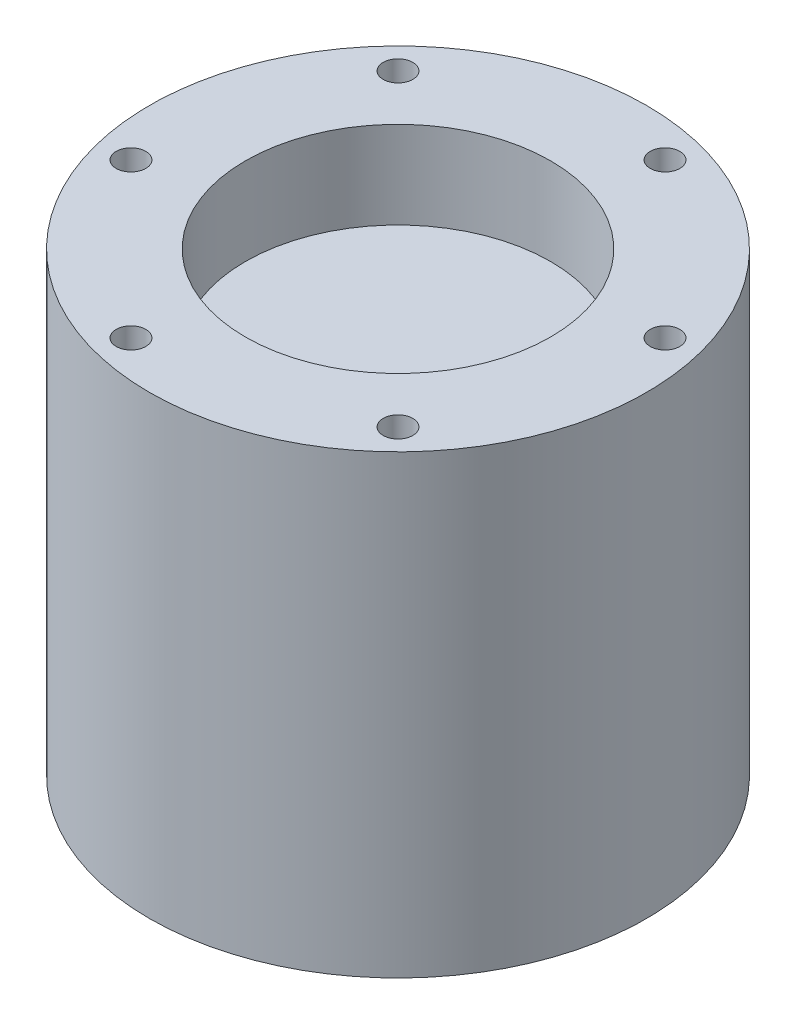
ISO-10303-21;
HEADER;
FILE_DESCRIPTION(('STEP AP214'),'2;1');
FILE_NAME('part.step','',(''),(''),'','','');
FILE_SCHEMA(('AUTOMOTIVE_DESIGN { 1 0 10303 214 1 1 1 1 }'));
ENDSEC;
DATA;
#1=APPLICATION_CONTEXT('core data for automotive mechanical design processes');
#2=APPLICATION_PROTOCOL_DEFINITION('international standard','automotive_design',2000,#1);
#3=PRODUCT_CONTEXT('',#1,'mechanical');
#4=PRODUCT('Part','Part','',(#3));
#5=PRODUCT_RELATED_PRODUCT_CATEGORY('part','',(#4));
#6=PRODUCT_DEFINITION_FORMATION('','',#4);
#7=PRODUCT_DEFINITION_CONTEXT('part definition',#1,'design');
#8=PRODUCT_DEFINITION('design','',#6,#7);
#9=PRODUCT_DEFINITION_SHAPE('','',#8);
#10=(LENGTH_UNIT() NAMED_UNIT(*) SI_UNIT(.MILLI.,.METRE.));
#11=(NAMED_UNIT(*) PLANE_ANGLE_UNIT() SI_UNIT($,.RADIAN.));
#12=(NAMED_UNIT(*) SI_UNIT($,.STERADIAN.) SOLID_ANGLE_UNIT());
#13=UNCERTAINTY_MEASURE_WITH_UNIT(LENGTH_MEASURE(1.E-05),#10,'distance_accuracy_value','');
#14=(GEOMETRIC_REPRESENTATION_CONTEXT(3) GLOBAL_UNCERTAINTY_ASSIGNED_CONTEXT((#13)) GLOBAL_UNIT_ASSIGNED_CONTEXT((#10,
#11,#12)) REPRESENTATION_CONTEXT('',''));
#15=CARTESIAN_POINT('',(0.,0.,0.));
#16=DIRECTION('',(0.,0.,1.));
#17=DIRECTION('',(1.,0.,0.));
#18=AXIS2_PLACEMENT_3D('',#15,#16,#17);
#19=CARTESIAN_POINT('',(0.,52.25,0.));
#20=DIRECTION('',(0.,-1.,0.));
#21=DIRECTION('',(0.,0.,-1.));
#22=AXIS2_PLACEMENT_3D('',#19,#20,#21);
#23=CYLINDRICAL_SURFACE('',#22,28.5);
#24=CARTESIAN_POINT('',(0.,52.25,0.));
#25=DIRECTION('',(0.,1.,0.));
#26=DIRECTION('',(0.,0.,1.));
#27=AXIS2_PLACEMENT_3D('',#24,#25,#26);
#28=CIRCLE('',#27,28.5);
#29=CARTESIAN_POINT('',(0.,52.25,28.5));
#30=VERTEX_POINT('',#29);
#31=EDGE_CURVE('E10',#30,#30,#28,.T.);
#32=ORIENTED_EDGE('',*,*,#31,.F.);
#33=EDGE_LOOP('',(#32));
#34=FACE_BOUND('',#33,.T.);
#35=CARTESIAN_POINT('',(0.,0.,0.));
#36=DIRECTION('',(0.,1.,0.));
#37=DIRECTION('',(0.,0.,1.));
#38=AXIS2_PLACEMENT_3D('',#35,#36,#37);
#39=CIRCLE('',#38,28.5);
#40=CARTESIAN_POINT('',(0.,0.,28.5));
#41=VERTEX_POINT('',#40);
#42=EDGE_CURVE('E37',#41,#41,#39,.T.);
#43=ORIENTED_EDGE('',*,*,#42,.T.);
#44=EDGE_LOOP('',(#43));
#45=FACE_BOUND('',#44,.T.);
#46=ADVANCED_FACE('F34',(#34,#45),#23,.T.);
#47=CARTESIAN_POINT('',(0.,52.25,0.));
#48=DIRECTION('',(0.,1.,0.));
#49=DIRECTION('',(0.,0.,1.));
#50=AXIS2_PLACEMENT_3D('',#47,#48,#49);
#51=PLANE('',#50);
#52=CARTESIAN_POINT('',(-6.47047612756301,52.25,24.1481456572267));
#53=DIRECTION('',(0.,1.,0.));
#54=DIRECTION('',(0.,0.,1.));
#55=AXIS2_PLACEMENT_3D('',#52,#53,#54);
#56=CIRCLE('',#55,1.7);
#57=CARTESIAN_POINT('',(-6.47047612756301,52.25,25.8481456572267));
#58=VERTEX_POINT('',#57);
#59=EDGE_CURVE('E83',#58,#58,#56,.T.);
#60=ORIENTED_EDGE('',*,*,#59,.F.);
#61=EDGE_LOOP('',(#60));
#62=FACE_BOUND('',#61,.T.);
#63=CARTESIAN_POINT('',(-24.1481456572267,52.25,6.47047612756303));
#64=DIRECTION('',(0.,1.,0.));
#65=DIRECTION('',(0.,0.,1.));
#66=AXIS2_PLACEMENT_3D('',#63,#64,#65);
#67=CIRCLE('',#66,1.7);
#68=CARTESIAN_POINT('',(-24.1481456572267,52.25,8.17047612756303));
#69=VERTEX_POINT('',#68);
#70=EDGE_CURVE('E77',#69,#69,#67,.T.);
#71=ORIENTED_EDGE('',*,*,#70,.F.);
#72=EDGE_LOOP('',(#71));
#73=FACE_BOUND('',#72,.T.);
#74=CARTESIAN_POINT('',(-17.6776695296637,52.25,-17.6776695296637));
#75=DIRECTION('',(0.,1.,0.));
#76=DIRECTION('',(0.,0.,1.));
#77=AXIS2_PLACEMENT_3D('',#74,#75,#76);
#78=CIRCLE('',#77,1.7);
#79=CARTESIAN_POINT('',(-17.6776695296637,52.25,-15.9776695296637));
#80=VERTEX_POINT('',#79);
#81=EDGE_CURVE('E71',#80,#80,#78,.T.);
#82=ORIENTED_EDGE('',*,*,#81,.F.);
#83=EDGE_LOOP('',(#82));
#84=FACE_BOUND('',#83,.T.);
#85=CARTESIAN_POINT('',(6.470476127563,52.25,-24.1481456572267));
#86=DIRECTION('',(0.,1.,0.));
#87=DIRECTION('',(0.,0.,1.));
#88=AXIS2_PLACEMENT_3D('',#85,#86,#87);
#89=CIRCLE('',#88,1.7);
#90=CARTESIAN_POINT('',(6.470476127563,52.25,-22.4481456572267));
#91=VERTEX_POINT('',#90);
#92=EDGE_CURVE('E65',#91,#91,#89,.T.);
#93=ORIENTED_EDGE('',*,*,#92,.F.);
#94=EDGE_LOOP('',(#93));
#95=FACE_BOUND('',#94,.T.);
#96=CARTESIAN_POINT('',(24.1481456572267,52.25,-6.47047612756303));
#97=DIRECTION('',(0.,1.,0.));
#98=DIRECTION('',(0.,0.,1.));
#99=AXIS2_PLACEMENT_3D('',#96,#97,#98);
#100=CIRCLE('',#99,1.7);
#101=CARTESIAN_POINT('',(24.1481456572267,52.25,-4.77047612756303));
#102=VERTEX_POINT('',#101);
#103=EDGE_CURVE('E58',#102,#102,#100,.T.);
#104=ORIENTED_EDGE('',*,*,#103,.F.);
#105=EDGE_LOOP('',(#104));
#106=FACE_BOUND('',#105,.T.);
#107=CARTESIAN_POINT('',(17.6776695296637,52.25,17.6776695296637));
#108=DIRECTION('',(0.,1.,0.));
#109=DIRECTION('',(0.,0.,1.));
#110=AXIS2_PLACEMENT_3D('',#107,#108,#109);
#111=CIRCLE('',#110,1.69999999999995);
#112=CARTESIAN_POINT('',(17.6776695296637,52.25,19.3776695296636));
#113=VERTEX_POINT('',#112);
#114=EDGE_CURVE('E52',#113,#113,#111,.T.);
#115=ORIENTED_EDGE('',*,*,#114,.F.);
#116=EDGE_LOOP('',(#115));
#117=FACE_BOUND('',#116,.T.);
#118=CARTESIAN_POINT('',(0.,52.25,0.));
#119=DIRECTION('',(0.,1.,0.));
#120=DIRECTION('',(0.,0.,1.));
#121=AXIS2_PLACEMENT_3D('',#118,#119,#120);
#122=CIRCLE('',#121,17.5);
#123=CARTESIAN_POINT('',(0.,52.25,17.5));
#124=VERTEX_POINT('',#123);
#125=EDGE_CURVE('E46',#124,#124,#122,.T.);
#126=ORIENTED_EDGE('',*,*,#125,.F.);
#127=EDGE_LOOP('',(#126));
#128=FACE_BOUND('',#127,.T.);
#129=ORIENTED_EDGE('',*,*,#31,.T.);
#130=EDGE_LOOP('',(#129));
#131=FACE_BOUND('',#130,.T.);
#132=ADVANCED_FACE('F125',(#62,#73,#84,#95,#106,#117,#128,#131),#51,.T.);
#133=CARTESIAN_POINT('',(0.,0.,0.));
#134=DIRECTION('',(0.,1.,0.));
#135=DIRECTION('',(0.,0.,1.));
#136=AXIS2_PLACEMENT_3D('',#133,#134,#135);
#137=PLANE('',#136);
#138=CARTESIAN_POINT('',(-19.,0.,0.));
#139=DIRECTION('',(0.,-1.,0.));
#140=DIRECTION('',(0.,0.,-1.));
#141=AXIS2_PLACEMENT_3D('',#138,#139,#140);
#142=CIRCLE('',#141,1.5);
#143=CARTESIAN_POINT('',(-19.,0.,-1.49999999999993));
#144=VERTEX_POINT('',#143);
#145=EDGE_CURVE('E106',#144,#144,#142,.T.);
#146=ORIENTED_EDGE('',*,*,#145,.F.);
#147=EDGE_LOOP('',(#146));
#148=FACE_BOUND('',#147,.T.);
#149=CARTESIAN_POINT('',(1.32676290876039E-13,0.,19.));
#150=DIRECTION('',(0.,-1.,0.));
#151=DIRECTION('',(0.,0.,-1.));
#152=AXIS2_PLACEMENT_3D('',#149,#150,#151);
#153=CIRCLE('',#152,1.5);
#154=CARTESIAN_POINT('',(1.32676290876039E-13,0.,17.5));
#155=VERTEX_POINT('',#154);
#156=EDGE_CURVE('E100',#155,#155,#153,.T.);
#157=ORIENTED_EDGE('',*,*,#156,.F.);
#158=EDGE_LOOP('',(#157));
#159=FACE_BOUND('',#158,.T.);
#160=CARTESIAN_POINT('',(19.,0.,-1.99014436314059E-13));
#161=DIRECTION('',(0.,-1.,0.));
#162=DIRECTION('',(0.,0.,-1.));
#163=AXIS2_PLACEMENT_3D('',#160,#161,#162);
#164=CIRCLE('',#163,1.5);
#165=CARTESIAN_POINT('',(19.,0.,-1.5000000000002));
#166=VERTEX_POINT('',#165);
#167=EDGE_CURVE('E94',#166,#166,#164,.T.);
#168=ORIENTED_EDGE('',*,*,#167,.F.);
#169=EDGE_LOOP('',(#168));
#170=FACE_BOUND('',#169,.T.);
#171=CARTESIAN_POINT('',(0.,0.,-19.));
#172=DIRECTION('',(0.,-1.,0.));
#173=DIRECTION('',(0.,0.,-1.));
#174=AXIS2_PLACEMENT_3D('',#171,#172,#173);
#175=CIRCLE('',#174,1.5);
#176=CARTESIAN_POINT('',(0.,0.,-20.5));
#177=VERTEX_POINT('',#176);
#178=EDGE_CURVE('E88',#177,#177,#175,.T.);
#179=ORIENTED_EDGE('',*,*,#178,.F.);
#180=EDGE_LOOP('',(#179));
#181=FACE_BOUND('',#180,.T.);
#182=ORIENTED_EDGE('',*,*,#42,.F.);
#183=EDGE_LOOP('',(#182));
#184=FACE_BOUND('',#183,.T.);
#185=ADVANCED_FACE('F121',(#148,#159,#170,#181,#184),#137,.F.);
#186=CARTESIAN_POINT('',(0.,42.25,0.));
#187=DIRECTION('',(0.,1.,0.));
#188=DIRECTION('',(0.,0.,1.));
#189=AXIS2_PLACEMENT_3D('',#186,#187,#188);
#190=CYLINDRICAL_SURFACE('',#189,17.5);
#191=CARTESIAN_POINT('',(0.,42.25,0.));
#192=DIRECTION('',(0.,1.,0.));
#193=DIRECTION('',(0.,0.,1.));
#194=AXIS2_PLACEMENT_3D('',#191,#192,#193);
#195=CIRCLE('',#194,17.5);
#196=CARTESIAN_POINT('',(0.,42.25,17.5));
#197=VERTEX_POINT('',#196);
#198=EDGE_CURVE('E44',#197,#197,#195,.T.);
#199=ORIENTED_EDGE('',*,*,#198,.F.);
#200=EDGE_LOOP('',(#199));
#201=FACE_BOUND('',#200,.T.);
#202=ORIENTED_EDGE('',*,*,#125,.T.);
#203=EDGE_LOOP('',(#202));
#204=FACE_BOUND('',#203,.T.);
#205=ADVANCED_FACE('F124',(#201,#204),#190,.F.);
#206=CARTESIAN_POINT('',(0.,42.25,0.));
#207=DIRECTION('',(0.,1.,0.));
#208=DIRECTION('',(0.,0.,1.));
#209=AXIS2_PLACEMENT_3D('',#206,#207,#208);
#210=PLANE('',#209);
#211=ORIENTED_EDGE('',*,*,#198,.T.);
#212=EDGE_LOOP('',(#211));
#213=FACE_BOUND('',#212,.T.);
#214=ADVANCED_FACE('F150',(#213),#210,.T.);
#215=CARTESIAN_POINT('',(17.6776695296637,42.25,17.6776695296637));
#216=DIRECTION('',(0.,1.,0.));
#217=DIRECTION('',(0.,0.,1.));
#218=AXIS2_PLACEMENT_3D('',#215,#216,#217);
#219=CYLINDRICAL_SURFACE('',#218,1.69999999999995);
#220=CARTESIAN_POINT('',(17.6776695296637,42.25,17.6776695296637));
#221=DIRECTION('',(0.,1.,0.));
#222=DIRECTION('',(0.,0.,1.));
#223=AXIS2_PLACEMENT_3D('',#220,#221,#222);
#224=CIRCLE('',#223,1.69999999999995);
#225=CARTESIAN_POINT('',(17.6776695296637,42.25,19.3776695296636));
#226=VERTEX_POINT('',#225);
#227=EDGE_CURVE('E49',#226,#226,#224,.T.);
#228=ORIENTED_EDGE('',*,*,#227,.F.);
#229=EDGE_LOOP('',(#228));
#230=FACE_BOUND('',#229,.T.);
#231=ORIENTED_EDGE('',*,*,#114,.T.);
#232=EDGE_LOOP('',(#231));
#233=FACE_BOUND('',#232,.T.);
#234=ADVANCED_FACE('F154',(#230,#233),#219,.F.);
#235=CARTESIAN_POINT('',(17.6776695296637,42.25,17.6776695296637));
#236=DIRECTION('',(0.,1.,0.));
#237=DIRECTION('',(0.,0.,1.));
#238=AXIS2_PLACEMENT_3D('',#235,#236,#237);
#239=PLANE('',#238);
#240=ORIENTED_EDGE('',*,*,#227,.T.);
#241=EDGE_LOOP('',(#240));
#242=FACE_BOUND('',#241,.T.);
#243=ADVANCED_FACE('F158',(#242),#239,.T.);
#244=CARTESIAN_POINT('',(24.1481456572267,42.25,-6.47047612756303));
#245=DIRECTION('',(0.,1.,0.));
#246=DIRECTION('',(0.,0.,1.));
#247=AXIS2_PLACEMENT_3D('',#244,#245,#246);
#248=CYLINDRICAL_SURFACE('',#247,1.7);
#249=CARTESIAN_POINT('',(24.1481456572267,42.25,-6.47047612756303));
#250=DIRECTION('',(0.,1.,0.));
#251=DIRECTION('',(0.,0.,1.));
#252=AXIS2_PLACEMENT_3D('',#249,#250,#251);
#253=CIRCLE('',#252,1.7);
#254=CARTESIAN_POINT('',(24.1481456572267,42.25,-4.77047612756303));
#255=VERTEX_POINT('',#254);
#256=EDGE_CURVE('E61',#255,#255,#253,.T.);
#257=ORIENTED_EDGE('',*,*,#256,.F.);
#258=EDGE_LOOP('',(#257));
#259=FACE_BOUND('',#258,.T.);
#260=ORIENTED_EDGE('',*,*,#103,.T.);
#261=EDGE_LOOP('',(#260));
#262=FACE_BOUND('',#261,.T.);
#263=ADVANCED_FACE('F162',(#259,#262),#248,.F.);
#264=CARTESIAN_POINT('',(24.1481456572267,42.25,-6.47047612756303));
#265=DIRECTION('',(0.,1.,0.));
#266=DIRECTION('',(0.,0.,1.));
#267=AXIS2_PLACEMENT_3D('',#264,#265,#266);
#268=PLANE('',#267);
#269=ORIENTED_EDGE('',*,*,#256,.T.);
#270=EDGE_LOOP('',(#269));
#271=FACE_BOUND('',#270,.T.);
#272=ADVANCED_FACE('F166',(#271),#268,.T.);
#273=CARTESIAN_POINT('',(6.470476127563,42.25,-24.1481456572267));
#274=DIRECTION('',(0.,1.,0.));
#275=DIRECTION('',(0.,0.,1.));
#276=AXIS2_PLACEMENT_3D('',#273,#274,#275);
#277=CYLINDRICAL_SURFACE('',#276,1.7);
#278=CARTESIAN_POINT('',(6.470476127563,42.25,-24.1481456572267));
#279=DIRECTION('',(0.,1.,0.));
#280=DIRECTION('',(0.,0.,1.));
#281=AXIS2_PLACEMENT_3D('',#278,#279,#280);
#282=CIRCLE('',#281,1.7);
#283=CARTESIAN_POINT('',(6.470476127563,42.25,-22.4481456572267));
#284=VERTEX_POINT('',#283);
#285=EDGE_CURVE('E68',#284,#284,#282,.T.);
#286=ORIENTED_EDGE('',*,*,#285,.F.);
#287=EDGE_LOOP('',(#286));
#288=FACE_BOUND('',#287,.T.);
#289=ORIENTED_EDGE('',*,*,#92,.T.);
#290=EDGE_LOOP('',(#289));
#291=FACE_BOUND('',#290,.T.);
#292=ADVANCED_FACE('F170',(#288,#291),#277,.F.);
#293=CARTESIAN_POINT('',(6.470476127563,42.25,-24.1481456572267));
#294=DIRECTION('',(0.,1.,0.));
#295=DIRECTION('',(0.,0.,1.));
#296=AXIS2_PLACEMENT_3D('',#293,#294,#295);
#297=PLANE('',#296);
#298=ORIENTED_EDGE('',*,*,#285,.T.);
#299=EDGE_LOOP('',(#298));
#300=FACE_BOUND('',#299,.T.);
#301=ADVANCED_FACE('F174',(#300),#297,.T.);
#302=CARTESIAN_POINT('',(-17.6776695296637,42.25,-17.6776695296637));
#303=DIRECTION('',(0.,1.,0.));
#304=DIRECTION('',(0.,0.,1.));
#305=AXIS2_PLACEMENT_3D('',#302,#303,#304);
#306=CYLINDRICAL_SURFACE('',#305,1.7);
#307=CARTESIAN_POINT('',(-17.6776695296637,42.25,-17.6776695296637));
#308=DIRECTION('',(0.,1.,0.));
#309=DIRECTION('',(0.,0.,1.));
#310=AXIS2_PLACEMENT_3D('',#307,#308,#309);
#311=CIRCLE('',#310,1.7);
#312=CARTESIAN_POINT('',(-17.6776695296637,42.25,-15.9776695296637));
#313=VERTEX_POINT('',#312);
#314=EDGE_CURVE('E74',#313,#313,#311,.T.);
#315=ORIENTED_EDGE('',*,*,#314,.F.);
#316=EDGE_LOOP('',(#315));
#317=FACE_BOUND('',#316,.T.);
#318=ORIENTED_EDGE('',*,*,#81,.T.);
#319=EDGE_LOOP('',(#318));
#320=FACE_BOUND('',#319,.T.);
#321=ADVANCED_FACE('F178',(#317,#320),#306,.F.);
#322=CARTESIAN_POINT('',(-17.6776695296637,42.25,-17.6776695296637));
#323=DIRECTION('',(0.,1.,0.));
#324=DIRECTION('',(0.,0.,1.));
#325=AXIS2_PLACEMENT_3D('',#322,#323,#324);
#326=PLANE('',#325);
#327=ORIENTED_EDGE('',*,*,#314,.T.);
#328=EDGE_LOOP('',(#327));
#329=FACE_BOUND('',#328,.T.);
#330=ADVANCED_FACE('F182',(#329),#326,.T.);
#331=CARTESIAN_POINT('',(-24.1481456572267,42.25,6.47047612756303));
#332=DIRECTION('',(0.,1.,0.));
#333=DIRECTION('',(0.,0.,1.));
#334=AXIS2_PLACEMENT_3D('',#331,#332,#333);
#335=CYLINDRICAL_SURFACE('',#334,1.7);
#336=CARTESIAN_POINT('',(-24.1481456572267,42.25,6.47047612756303));
#337=DIRECTION('',(0.,1.,0.));
#338=DIRECTION('',(0.,0.,1.));
#339=AXIS2_PLACEMENT_3D('',#336,#337,#338);
#340=CIRCLE('',#339,1.7);
#341=CARTESIAN_POINT('',(-24.1481456572267,42.25,8.17047612756303));
#342=VERTEX_POINT('',#341);
#343=EDGE_CURVE('E80',#342,#342,#340,.T.);
#344=ORIENTED_EDGE('',*,*,#343,.F.);
#345=EDGE_LOOP('',(#344));
#346=FACE_BOUND('',#345,.T.);
#347=ORIENTED_EDGE('',*,*,#70,.T.);
#348=EDGE_LOOP('',(#347));
#349=FACE_BOUND('',#348,.T.);
#350=ADVANCED_FACE('F186',(#346,#349),#335,.F.);
#351=CARTESIAN_POINT('',(-24.1481456572267,42.25,6.47047612756303));
#352=DIRECTION('',(0.,1.,0.));
#353=DIRECTION('',(0.,0.,1.));
#354=AXIS2_PLACEMENT_3D('',#351,#352,#353);
#355=PLANE('',#354);
#356=ORIENTED_EDGE('',*,*,#343,.T.);
#357=EDGE_LOOP('',(#356));
#358=FACE_BOUND('',#357,.T.);
#359=ADVANCED_FACE('F190',(#358),#355,.T.);
#360=CARTESIAN_POINT('',(-6.47047612756301,42.25,24.1481456572267));
#361=DIRECTION('',(0.,1.,0.));
#362=DIRECTION('',(0.,0.,1.));
#363=AXIS2_PLACEMENT_3D('',#360,#361,#362);
#364=CYLINDRICAL_SURFACE('',#363,1.7);
#365=CARTESIAN_POINT('',(-6.47047612756301,42.25,24.1481456572267));
#366=DIRECTION('',(0.,1.,0.));
#367=DIRECTION('',(0.,0.,1.));
#368=AXIS2_PLACEMENT_3D('',#365,#366,#367);
#369=CIRCLE('',#368,1.7);
#370=CARTESIAN_POINT('',(-6.47047612756301,42.25,25.8481456572267));
#371=VERTEX_POINT('',#370);
#372=EDGE_CURVE('E55',#371,#371,#369,.T.);
#373=ORIENTED_EDGE('',*,*,#372,.F.);
#374=EDGE_LOOP('',(#373));
#375=FACE_BOUND('',#374,.T.);
#376=ORIENTED_EDGE('',*,*,#59,.T.);
#377=EDGE_LOOP('',(#376));
#378=FACE_BOUND('',#377,.T.);
#379=ADVANCED_FACE('F194',(#375,#378),#364,.F.);
#380=CARTESIAN_POINT('',(-6.47047612756301,42.25,24.1481456572267));
#381=DIRECTION('',(0.,1.,0.));
#382=DIRECTION('',(0.,0.,1.));
#383=AXIS2_PLACEMENT_3D('',#380,#381,#382);
#384=PLANE('',#383);
#385=ORIENTED_EDGE('',*,*,#372,.T.);
#386=EDGE_LOOP('',(#385));
#387=FACE_BOUND('',#386,.T.);
#388=ADVANCED_FACE('F198',(#387),#384,.T.);
#389=CARTESIAN_POINT('',(0.,10.,-19.));
#390=DIRECTION('',(0.,-1.,0.));
#391=DIRECTION('',(0.,0.,-1.));
#392=AXIS2_PLACEMENT_3D('',#389,#390,#391);
#393=CYLINDRICAL_SURFACE('',#392,1.5);
#394=CARTESIAN_POINT('',(0.,10.,-19.));
#395=DIRECTION('',(0.,-1.,0.));
#396=DIRECTION('',(0.,0.,-1.));
#397=AXIS2_PLACEMENT_3D('',#394,#395,#396);
#398=CIRCLE('',#397,1.5);
#399=CARTESIAN_POINT('',(0.,10.,-20.5));
#400=VERTEX_POINT('',#399);
#401=EDGE_CURVE('E62',#400,#400,#398,.T.);
#402=ORIENTED_EDGE('',*,*,#401,.F.);
#403=EDGE_LOOP('',(#402));
#404=FACE_BOUND('',#403,.T.);
#405=ORIENTED_EDGE('',*,*,#178,.T.);
#406=EDGE_LOOP('',(#405));
#407=FACE_BOUND('',#406,.T.);
#408=ADVANCED_FACE('F202',(#404,#407),#393,.F.);
#409=CARTESIAN_POINT('',(0.,10.,-19.));
#410=DIRECTION('',(0.,-1.,0.));
#411=DIRECTION('',(0.,0.,-1.));
#412=AXIS2_PLACEMENT_3D('',#409,#410,#411);
#413=PLANE('',#412);
#414=ORIENTED_EDGE('',*,*,#401,.T.);
#415=EDGE_LOOP('',(#414));
#416=FACE_BOUND('',#415,.T.);
#417=ADVANCED_FACE('F206',(#416),#413,.T.);
#418=CARTESIAN_POINT('',(19.,10.,-1.99014436314059E-13));
#419=DIRECTION('',(0.,-1.,0.));
#420=DIRECTION('',(0.,0.,-1.));
#421=AXIS2_PLACEMENT_3D('',#418,#419,#420);
#422=CYLINDRICAL_SURFACE('',#421,1.5);
#423=CARTESIAN_POINT('',(19.,10.,-1.99014436314059E-13));
#424=DIRECTION('',(0.,-1.,0.));
#425=DIRECTION('',(0.,0.,-1.));
#426=AXIS2_PLACEMENT_3D('',#423,#424,#425);
#427=CIRCLE('',#426,1.5);
#428=CARTESIAN_POINT('',(19.,10.,-1.5000000000002));
#429=VERTEX_POINT('',#428);
#430=EDGE_CURVE('E97',#429,#429,#427,.T.);
#431=ORIENTED_EDGE('',*,*,#430,.F.);
#432=EDGE_LOOP('',(#431));
#433=FACE_BOUND('',#432,.T.);
#434=ORIENTED_EDGE('',*,*,#167,.T.);
#435=EDGE_LOOP('',(#434));
#436=FACE_BOUND('',#435,.T.);
#437=ADVANCED_FACE('F210',(#433,#436),#422,.F.);
#438=CARTESIAN_POINT('',(19.,10.,-1.99014436314059E-13));
#439=DIRECTION('',(0.,-1.,0.));
#440=DIRECTION('',(0.,0.,-1.));
#441=AXIS2_PLACEMENT_3D('',#438,#439,#440);
#442=PLANE('',#441);
#443=ORIENTED_EDGE('',*,*,#430,.T.);
#444=EDGE_LOOP('',(#443));
#445=FACE_BOUND('',#444,.T.);
#446=ADVANCED_FACE('F214',(#445),#442,.T.);
#447=CARTESIAN_POINT('',(1.32676290876039E-13,10.,19.));
#448=DIRECTION('',(0.,-1.,0.));
#449=DIRECTION('',(0.,0.,-1.));
#450=AXIS2_PLACEMENT_3D('',#447,#448,#449);
#451=CYLINDRICAL_SURFACE('',#450,1.5);
#452=CARTESIAN_POINT('',(1.32676290876039E-13,10.,19.));
#453=DIRECTION('',(0.,-1.,0.));
#454=DIRECTION('',(0.,0.,-1.));
#455=AXIS2_PLACEMENT_3D('',#452,#453,#454);
#456=CIRCLE('',#455,1.5);
#457=CARTESIAN_POINT('',(1.32676290876039E-13,10.,17.5));
#458=VERTEX_POINT('',#457);
#459=EDGE_CURVE('E103',#458,#458,#456,.T.);
#460=ORIENTED_EDGE('',*,*,#459,.F.);
#461=EDGE_LOOP('',(#460));
#462=FACE_BOUND('',#461,.T.);
#463=ORIENTED_EDGE('',*,*,#156,.T.);
#464=EDGE_LOOP('',(#463));
#465=FACE_BOUND('',#464,.T.);
#466=ADVANCED_FACE('F218',(#462,#465),#451,.F.);
#467=CARTESIAN_POINT('',(1.32676290876039E-13,10.,19.));
#468=DIRECTION('',(0.,-1.,0.));
#469=DIRECTION('',(0.,0.,-1.));
#470=AXIS2_PLACEMENT_3D('',#467,#468,#469);
#471=PLANE('',#470);
#472=ORIENTED_EDGE('',*,*,#459,.T.);
#473=EDGE_LOOP('',(#472));
#474=FACE_BOUND('',#473,.T.);
#475=ADVANCED_FACE('F117',(#474),#471,.T.);
#476=CARTESIAN_POINT('',(-19.,10.,0.));
#477=DIRECTION('',(0.,-1.,0.));
#478=DIRECTION('',(0.,0.,-1.));
#479=AXIS2_PLACEMENT_3D('',#476,#477,#478);
#480=CYLINDRICAL_SURFACE('',#479,1.5);
#481=CARTESIAN_POINT('',(-19.,10.,0.));
#482=DIRECTION('',(0.,-1.,0.));
#483=DIRECTION('',(0.,0.,-1.));
#484=AXIS2_PLACEMENT_3D('',#481,#482,#483);
#485=CIRCLE('',#484,1.5);
#486=CARTESIAN_POINT('',(-19.,10.,-1.49999999999993));
#487=VERTEX_POINT('',#486);
#488=EDGE_CURVE('E91',#487,#487,#485,.T.);
#489=ORIENTED_EDGE('',*,*,#488,.F.);
#490=EDGE_LOOP('',(#489));
#491=FACE_BOUND('',#490,.T.);
#492=ORIENTED_EDGE('',*,*,#145,.T.);
#493=EDGE_LOOP('',(#492));
#494=FACE_BOUND('',#493,.T.);
#495=ADVANCED_FACE('F114',(#491,#494),#480,.F.);
#496=CARTESIAN_POINT('',(-19.,10.,0.));
#497=DIRECTION('',(0.,-1.,0.));
#498=DIRECTION('',(0.,0.,-1.));
#499=AXIS2_PLACEMENT_3D('',#496,#497,#498);
#500=PLANE('',#499);
#501=ORIENTED_EDGE('',*,*,#488,.T.);
#502=EDGE_LOOP('',(#501));
#503=FACE_BOUND('',#502,.T.);
#504=ADVANCED_FACE('F112',(#503),#500,.T.);
#505=CLOSED_SHELL('',(#46,#132,#185,#205,#214,#234,#243,#263,#272,#292,#301,#321,#330,#350,#359,
#379,#388,#408,#417,#437,#446,#466,#475,#495,#504));
#506=MANIFOLD_SOLID_BREP('B2',#505);
#507=ADVANCED_BREP_SHAPE_REPRESENTATION('',(#18,#506),#14);
#508=SHAPE_DEFINITION_REPRESENTATION(#9,#507);
ENDSEC;
END-ISO-10303-21;
